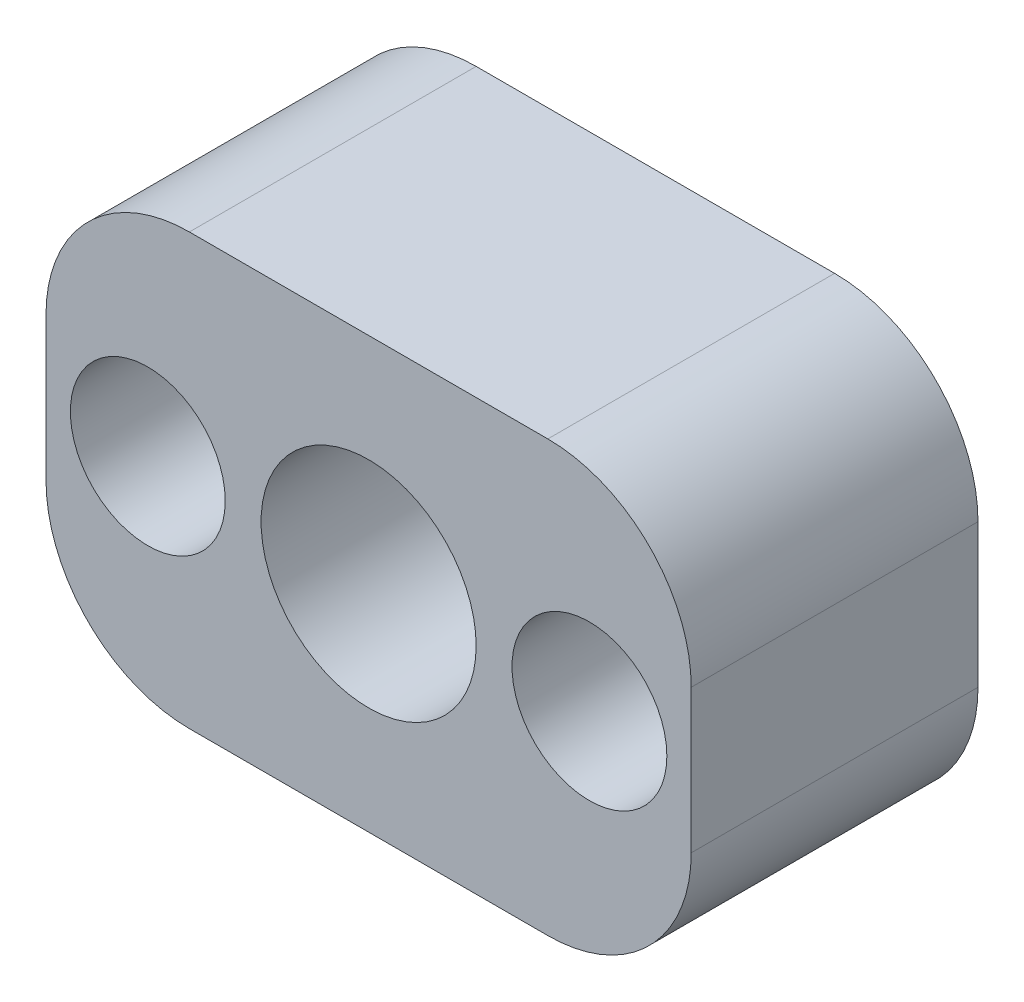
ISO-10303-21;
HEADER;
FILE_DESCRIPTION(('STEP AP214'),'2;1');
FILE_NAME('part.step','',(''),(''),'','','');
FILE_SCHEMA(('AUTOMOTIVE_DESIGN { 1 0 10303 214 1 1 1 1 }'));
ENDSEC;
DATA;
#1=APPLICATION_CONTEXT('core data for automotive mechanical design processes');
#2=APPLICATION_PROTOCOL_DEFINITION('international standard','automotive_design',2000,#1);
#3=PRODUCT_CONTEXT('',#1,'mechanical');
#4=PRODUCT('Part','Part','',(#3));
#5=PRODUCT_RELATED_PRODUCT_CATEGORY('part','',(#4));
#6=PRODUCT_DEFINITION_FORMATION('','',#4);
#7=PRODUCT_DEFINITION_CONTEXT('part definition',#1,'design');
#8=PRODUCT_DEFINITION('design','',#6,#7);
#9=PRODUCT_DEFINITION_SHAPE('','',#8);
#10=(LENGTH_UNIT() NAMED_UNIT(*) SI_UNIT(.MILLI.,.METRE.));
#11=(NAMED_UNIT(*) PLANE_ANGLE_UNIT() SI_UNIT($,.RADIAN.));
#12=(NAMED_UNIT(*) SI_UNIT($,.STERADIAN.) SOLID_ANGLE_UNIT());
#13=UNCERTAINTY_MEASURE_WITH_UNIT(LENGTH_MEASURE(1.E-05),#10,'distance_accuracy_value','');
#14=(GEOMETRIC_REPRESENTATION_CONTEXT(3) GLOBAL_UNCERTAINTY_ASSIGNED_CONTEXT((#13)) GLOBAL_UNIT_ASSIGNED_CONTEXT((#10,
#11,#12)) REPRESENTATION_CONTEXT('',''));
#15=CARTESIAN_POINT('',(0.,0.,0.));
#16=DIRECTION('',(0.,0.,1.));
#17=DIRECTION('',(1.,0.,0.));
#18=AXIS2_PLACEMENT_3D('',#15,#16,#17);
#19=CARTESIAN_POINT('',(-4.5085,-9.525,12.7));
#20=DIRECTION('',(0.,0.,-1.));
#21=DIRECTION('',(-1.,0.,0.));
#22=AXIS2_PLACEMENT_3D('',#19,#20,#21);
#23=CYLINDRICAL_SURFACE('',#22,1.905);
#24=CARTESIAN_POINT('',(-4.5085,-9.525,0.));
#25=DIRECTION('',(0.,0.,1.));
#26=DIRECTION('',(1.,0.,0.));
#27=AXIS2_PLACEMENT_3D('',#24,#25,#26);
#28=CIRCLE('',#27,1.905);
#29=CARTESIAN_POINT('',(-2.6035,-9.525,0.));
#30=VERTEX_POINT('',#29);
#31=EDGE_CURVE('E129',#30,#30,#28,.T.);
#32=ORIENTED_EDGE('',*,*,#31,.F.);
#33=EDGE_LOOP('',(#32));
#34=FACE_BOUND('',#33,.T.);
#35=CARTESIAN_POINT('',(-4.5085,-9.525,6.35));
#36=DIRECTION('',(0.,0.,1.));
#37=DIRECTION('',(1.,0.,0.));
#38=AXIS2_PLACEMENT_3D('',#35,#36,#37);
#39=CIRCLE('',#38,1.905);
#40=CARTESIAN_POINT('',(-2.6035,-9.525,6.35));
#41=VERTEX_POINT('',#40);
#42=EDGE_CURVE('E38',#41,#41,#39,.T.);
#43=ORIENTED_EDGE('',*,*,#42,.T.);
#44=EDGE_LOOP('',(#43));
#45=FACE_BOUND('',#44,.T.);
#46=ADVANCED_FACE('F34',(#34,#45),#23,.F.);
#47=CARTESIAN_POINT('',(-24.0665,-9.525,12.7));
#48=DIRECTION('',(0.,0.,-1.));
#49=DIRECTION('',(-1.,0.,0.));
#50=AXIS2_PLACEMENT_3D('',#47,#48,#49);
#51=CYLINDRICAL_SURFACE('',#50,1.905);
#52=CARTESIAN_POINT('',(-24.0665,-9.525,0.));
#53=DIRECTION('',(0.,0.,1.));
#54=DIRECTION('',(1.,0.,0.));
#55=AXIS2_PLACEMENT_3D('',#52,#53,#54);
#56=CIRCLE('',#55,1.905);
#57=CARTESIAN_POINT('',(-22.1615,-9.525,0.));
#58=VERTEX_POINT('',#57);
#59=EDGE_CURVE('E141',#58,#58,#56,.T.);
#60=ORIENTED_EDGE('',*,*,#59,.F.);
#61=EDGE_LOOP('',(#60));
#62=FACE_BOUND('',#61,.T.);
#63=CARTESIAN_POINT('',(-24.0665,-9.525,6.35));
#64=DIRECTION('',(0.,0.,1.));
#65=DIRECTION('',(1.,0.,0.));
#66=AXIS2_PLACEMENT_3D('',#63,#64,#65);
#67=CIRCLE('',#66,1.905);
#68=CARTESIAN_POINT('',(-22.1615,-9.525,6.35));
#69=VERTEX_POINT('',#68);
#70=EDGE_CURVE('E166',#69,#69,#67,.T.);
#71=ORIENTED_EDGE('',*,*,#70,.T.);
#72=EDGE_LOOP('',(#71));
#73=FACE_BOUND('',#72,.T.);
#74=ADVANCED_FACE('F222',(#62,#73),#51,.F.);
#75=CARTESIAN_POINT('',(0.,-19.05,12.7));
#76=DIRECTION('',(0.,-1.,0.));
#77=DIRECTION('',(0.,0.,-1.));
#78=AXIS2_PLACEMENT_3D('',#75,#76,#77);
#79=PLANE('',#78);
#80=DIRECTION('',(-1.,0.,0.));
#81=VECTOR('',#80,1.);
#82=CARTESIAN_POINT('',(0.,-19.05,12.7));
#83=LINE('',#82,#81);
#84=CARTESIAN_POINT('',(-6.35,-19.05,12.7));
#85=VERTEX_POINT('',#84);
#86=CARTESIAN_POINT('',(-22.225,-19.05,12.7));
#87=VERTEX_POINT('',#86);
#88=EDGE_CURVE('E144',#85,#87,#83,.T.);
#89=ORIENTED_EDGE('',*,*,#88,.T.);
#90=DIRECTION('',(0.,0.,-1.));
#91=VECTOR('',#90,1.);
#92=CARTESIAN_POINT('',(-22.225,-19.05,0.));
#93=LINE('',#92,#91);
#94=CARTESIAN_POINT('',(-22.225,-19.05,0.));
#95=VERTEX_POINT('',#94);
#96=EDGE_CURVE('E163',#87,#95,#93,.T.);
#97=ORIENTED_EDGE('',*,*,#96,.T.);
#98=DIRECTION('',(-1.,0.,0.));
#99=VECTOR('',#98,1.);
#100=CARTESIAN_POINT('',(0.,-19.05,0.));
#101=LINE('',#100,#99);
#102=CARTESIAN_POINT('',(-6.35,-19.05,0.));
#103=VERTEX_POINT('',#102);
#104=EDGE_CURVE('E172',#103,#95,#101,.T.);
#105=ORIENTED_EDGE('',*,*,#104,.F.);
#106=DIRECTION('',(0.,0.,-1.));
#107=VECTOR('',#106,1.);
#108=CARTESIAN_POINT('',(-6.35,-19.05,12.7));
#109=LINE('',#108,#107);
#110=EDGE_CURVE('E161',#103,#85,#109,.F.);
#111=ORIENTED_EDGE('',*,*,#110,.T.);
#112=EDGE_LOOP('',(#89,#97,#105,#111));
#113=FACE_BOUND('',#112,.T.);
#114=ADVANCED_FACE('F218',(#113),#79,.T.);
#115=CARTESIAN_POINT('',(0.,0.,12.7));
#116=DIRECTION('',(1.,0.,0.));
#117=DIRECTION('',(0.,1.,0.));
#118=AXIS2_PLACEMENT_3D('',#115,#116,#117);
#119=PLANE('',#118);
#120=DIRECTION('',(0.,-1.,0.));
#121=VECTOR('',#120,1.);
#122=CARTESIAN_POINT('',(0.,0.,12.7));
#123=LINE('',#122,#121);
#124=CARTESIAN_POINT('',(0.,-6.35,12.7));
#125=VERTEX_POINT('',#124);
#126=CARTESIAN_POINT('',(0.,-12.7,12.7));
#127=VERTEX_POINT('',#126);
#128=EDGE_CURVE('E189',#125,#127,#123,.T.);
#129=ORIENTED_EDGE('',*,*,#128,.T.);
#130=DIRECTION('',(0.,0.,-1.));
#131=VECTOR('',#130,1.);
#132=CARTESIAN_POINT('',(0.,-12.7,12.7));
#133=LINE('',#132,#131);
#134=CARTESIAN_POINT('',(0.,-12.7,0.));
#135=VERTEX_POINT('',#134);
#136=EDGE_CURVE('E11',#127,#135,#133,.T.);
#137=ORIENTED_EDGE('',*,*,#136,.T.);
#138=DIRECTION('',(0.,-1.,0.));
#139=VECTOR('',#138,1.);
#140=CARTESIAN_POINT('',(0.,0.,0.));
#141=LINE('',#140,#139);
#142=CARTESIAN_POINT('',(0.,-6.35,0.));
#143=VERTEX_POINT('',#142);
#144=EDGE_CURVE('E135',#143,#135,#141,.T.);
#145=ORIENTED_EDGE('',*,*,#144,.F.);
#146=DIRECTION('',(0.,0.,-1.));
#147=VECTOR('',#146,1.);
#148=CARTESIAN_POINT('',(0.,-6.35,12.7));
#149=LINE('',#148,#147);
#150=EDGE_CURVE('E43',#143,#125,#149,.F.);
#151=ORIENTED_EDGE('',*,*,#150,.T.);
#152=EDGE_LOOP('',(#129,#137,#145,#151));
#153=FACE_BOUND('',#152,.T.);
#154=ADVANCED_FACE('F199',(#153),#119,.T.);
#155=CARTESIAN_POINT('',(0.,0.,12.7));
#156=DIRECTION('',(0.,-1.,0.));
#157=DIRECTION('',(1.,0.,0.));
#158=AXIS2_PLACEMENT_3D('',#155,#156,#157);
#159=PLANE('',#158);
#160=DIRECTION('',(-1.,0.,0.));
#161=VECTOR('',#160,1.);
#162=CARTESIAN_POINT('',(0.,0.,0.));
#163=LINE('',#162,#161);
#164=CARTESIAN_POINT('',(-6.35,0.,0.));
#165=VERTEX_POINT('',#164);
#166=CARTESIAN_POINT('',(-22.225,0.,0.));
#167=VERTEX_POINT('',#166);
#168=EDGE_CURVE('E130',#165,#167,#163,.T.);
#169=ORIENTED_EDGE('',*,*,#168,.T.);
#170=DIRECTION('',(0.,0.,-1.));
#171=VECTOR('',#170,1.);
#172=CARTESIAN_POINT('',(-22.225,0.,12.7));
#173=LINE('',#172,#171);
#174=CARTESIAN_POINT('',(-22.225,0.,12.7));
#175=VERTEX_POINT('',#174);
#176=EDGE_CURVE('E107',#167,#175,#173,.F.);
#177=ORIENTED_EDGE('',*,*,#176,.T.);
#178=DIRECTION('',(-1.,0.,0.));
#179=VECTOR('',#178,1.);
#180=CARTESIAN_POINT('',(0.,0.,12.7));
#181=LINE('',#180,#179);
#182=CARTESIAN_POINT('',(-6.35,0.,12.7));
#183=VERTEX_POINT('',#182);
#184=EDGE_CURVE('E191',#183,#175,#181,.T.);
#185=ORIENTED_EDGE('',*,*,#184,.F.);
#186=DIRECTION('',(0.,0.,-1.));
#187=VECTOR('',#186,1.);
#188=CARTESIAN_POINT('',(-6.35,0.,0.));
#189=LINE('',#188,#187);
#190=EDGE_CURVE('E112',#183,#165,#189,.T.);
#191=ORIENTED_EDGE('',*,*,#190,.T.);
#192=EDGE_LOOP('',(#169,#177,#185,#191));
#193=FACE_BOUND('',#192,.T.);
#194=ADVANCED_FACE('F208',(#193),#159,.F.);
#195=CARTESIAN_POINT('',(-14.2875,-9.525,12.7));
#196=DIRECTION('',(0.,0.,-1.));
#197=DIRECTION('',(-1.,0.,0.));
#198=AXIS2_PLACEMENT_3D('',#195,#196,#197);
#199=CYLINDRICAL_SURFACE('',#198,4.7625);
#200=CARTESIAN_POINT('',(-14.2875,-9.525,12.7));
#201=DIRECTION('',(0.,0.,1.));
#202=DIRECTION('',(1.,0.,0.));
#203=AXIS2_PLACEMENT_3D('',#200,#201,#202);
#204=CIRCLE('',#203,4.7625);
#205=CARTESIAN_POINT('',(-9.525,-9.525,12.7));
#206=VERTEX_POINT('',#205);
#207=EDGE_CURVE('E145',#206,#206,#204,.T.);
#208=ORIENTED_EDGE('',*,*,#207,.T.);
#209=EDGE_LOOP('',(#208));
#210=FACE_BOUND('',#209,.T.);
#211=CARTESIAN_POINT('',(-14.2875,-9.525,0.));
#212=DIRECTION('',(0.,0.,1.));
#213=DIRECTION('',(1.,0.,0.));
#214=AXIS2_PLACEMENT_3D('',#211,#212,#213);
#215=CIRCLE('',#214,4.7625);
#216=CARTESIAN_POINT('',(-9.525,-9.525,0.));
#217=VERTEX_POINT('',#216);
#218=EDGE_CURVE('E133',#217,#217,#215,.T.);
#219=ORIENTED_EDGE('',*,*,#218,.F.);
#220=EDGE_LOOP('',(#219));
#221=FACE_BOUND('',#220,.T.);
#222=ADVANCED_FACE('F210',(#210,#221),#199,.F.);
#223=CARTESIAN_POINT('',(-28.575,0.,12.7));
#224=DIRECTION('',(1.,0.,0.));
#225=DIRECTION('',(0.,0.,-1.));
#226=AXIS2_PLACEMENT_3D('',#223,#224,#225);
#227=PLANE('',#226);
#228=DIRECTION('',(0.,-1.,0.));
#229=VECTOR('',#228,1.);
#230=CARTESIAN_POINT('',(-28.575,0.,12.7));
#231=LINE('',#230,#229);
#232=CARTESIAN_POINT('',(-28.575,-6.35,12.7));
#233=VERTEX_POINT('',#232);
#234=CARTESIAN_POINT('',(-28.575,-12.7,12.7));
#235=VERTEX_POINT('',#234);
#236=EDGE_CURVE('E122',#233,#235,#231,.T.);
#237=ORIENTED_EDGE('',*,*,#236,.F.);
#238=DIRECTION('',(0.,0.,-1.));
#239=VECTOR('',#238,1.);
#240=CARTESIAN_POINT('',(-28.575,-6.35,12.7));
#241=LINE('',#240,#239);
#242=CARTESIAN_POINT('',(-28.575,-6.35,0.));
#243=VERTEX_POINT('',#242);
#244=EDGE_CURVE('E106',#233,#243,#241,.T.);
#245=ORIENTED_EDGE('',*,*,#244,.T.);
#246=DIRECTION('',(0.,-1.,0.));
#247=VECTOR('',#246,1.);
#248=CARTESIAN_POINT('',(-28.575,0.,0.));
#249=LINE('',#248,#247);
#250=CARTESIAN_POINT('',(-28.575,-12.7,0.));
#251=VERTEX_POINT('',#250);
#252=EDGE_CURVE('E119',#243,#251,#249,.T.);
#253=ORIENTED_EDGE('',*,*,#252,.T.);
#254=DIRECTION('',(0.,0.,-1.));
#255=VECTOR('',#254,1.);
#256=CARTESIAN_POINT('',(-28.575,-12.7,12.7));
#257=LINE('',#256,#255);
#258=EDGE_CURVE('E124',#251,#235,#257,.F.);
#259=ORIENTED_EDGE('',*,*,#258,.T.);
#260=EDGE_LOOP('',(#237,#245,#253,#259));
#261=FACE_BOUND('',#260,.T.);
#262=ADVANCED_FACE('F118',(#261),#227,.F.);
#263=CARTESIAN_POINT('',(0.,0.,12.7));
#264=DIRECTION('',(0.,0.,1.));
#265=DIRECTION('',(1.,0.,0.));
#266=AXIS2_PLACEMENT_3D('',#263,#264,#265);
#267=PLANE('',#266);
#268=CARTESIAN_POINT('',(-24.0665,-9.525,12.7));
#269=DIRECTION('',(0.,0.,1.));
#270=DIRECTION('',(1.,0.,0.));
#271=AXIS2_PLACEMENT_3D('',#268,#269,#270);
#272=CIRCLE('',#271,3.429);
#273=CARTESIAN_POINT('',(-20.6375,-9.525,12.7));
#274=VERTEX_POINT('',#273);
#275=EDGE_CURVE('E174',#274,#274,#272,.T.);
#276=ORIENTED_EDGE('',*,*,#275,.F.);
#277=EDGE_LOOP('',(#276));
#278=FACE_BOUND('',#277,.T.);
#279=CARTESIAN_POINT('',(-4.5085,-9.525,12.7));
#280=DIRECTION('',(0.,0.,1.));
#281=DIRECTION('',(1.,0.,0.));
#282=AXIS2_PLACEMENT_3D('',#279,#280,#281);
#283=CIRCLE('',#282,3.429);
#284=CARTESIAN_POINT('',(-1.0795,-9.525,12.7));
#285=VERTEX_POINT('',#284);
#286=EDGE_CURVE('E184',#285,#285,#283,.T.);
#287=ORIENTED_EDGE('',*,*,#286,.F.);
#288=EDGE_LOOP('',(#287));
#289=FACE_BOUND('',#288,.T.);
#290=ORIENTED_EDGE('',*,*,#184,.T.);
#291=CARTESIAN_POINT('',(-22.225,-6.35,12.7));
#292=DIRECTION('',(0.,0.,1.));
#293=DIRECTION('',(1.,0.,0.));
#294=AXIS2_PLACEMENT_3D('',#291,#292,#293);
#295=CIRCLE('',#294,6.35);
#296=EDGE_CURVE('E159',#175,#233,#295,.T.);
#297=ORIENTED_EDGE('',*,*,#296,.T.);
#298=ORIENTED_EDGE('',*,*,#236,.T.);
#299=CARTESIAN_POINT('',(-22.225,-12.7,12.7));
#300=DIRECTION('',(0.,0.,1.));
#301=DIRECTION('',(1.,0.,0.));
#302=AXIS2_PLACEMENT_3D('',#299,#300,#301);
#303=CIRCLE('',#302,6.35);
#304=EDGE_CURVE('E157',#235,#87,#303,.T.);
#305=ORIENTED_EDGE('',*,*,#304,.T.);
#306=ORIENTED_EDGE('',*,*,#88,.F.);
#307=CARTESIAN_POINT('',(-6.35,-12.7,12.7));
#308=DIRECTION('',(0.,0.,1.));
#309=DIRECTION('',(1.,0.,0.));
#310=AXIS2_PLACEMENT_3D('',#307,#308,#309);
#311=CIRCLE('',#310,6.35);
#312=EDGE_CURVE('E51',#85,#127,#311,.T.);
#313=ORIENTED_EDGE('',*,*,#312,.T.);
#314=ORIENTED_EDGE('',*,*,#128,.F.);
#315=CARTESIAN_POINT('',(-6.35,-6.35,12.7));
#316=DIRECTION('',(0.,0.,1.));
#317=DIRECTION('',(1.,0.,0.));
#318=AXIS2_PLACEMENT_3D('',#315,#316,#317);
#319=CIRCLE('',#318,6.35);
#320=EDGE_CURVE('E154',#125,#183,#319,.T.);
#321=ORIENTED_EDGE('',*,*,#320,.T.);
#322=EDGE_LOOP('',(#290,#297,#298,#305,#306,#313,#314,#321));
#323=FACE_BOUND('',#322,.T.);
#324=ORIENTED_EDGE('',*,*,#207,.F.);
#325=EDGE_LOOP('',(#324));
#326=FACE_BOUND('',#325,.T.);
#327=ADVANCED_FACE('F205',(#278,#289,#323,#326),#267,.T.);
#328=CARTESIAN_POINT('',(0.,0.,0.));
#329=DIRECTION('',(0.,0.,1.));
#330=DIRECTION('',(1.,0.,0.));
#331=AXIS2_PLACEMENT_3D('',#328,#329,#330);
#332=PLANE('',#331);
#333=ORIENTED_EDGE('',*,*,#252,.F.);
#334=CARTESIAN_POINT('',(-22.225,-6.35,0.));
#335=DIRECTION('',(0.,0.,1.));
#336=DIRECTION('',(1.,0.,0.));
#337=AXIS2_PLACEMENT_3D('',#334,#335,#336);
#338=CIRCLE('',#337,6.35);
#339=EDGE_CURVE('E102',#243,#167,#338,.F.);
#340=ORIENTED_EDGE('',*,*,#339,.T.);
#341=ORIENTED_EDGE('',*,*,#168,.F.);
#342=CARTESIAN_POINT('',(-6.35,-6.35,0.));
#343=DIRECTION('',(0.,0.,1.));
#344=DIRECTION('',(1.,0.,0.));
#345=AXIS2_PLACEMENT_3D('',#342,#343,#344);
#346=CIRCLE('',#345,6.35);
#347=EDGE_CURVE('E123',#165,#143,#346,.F.);
#348=ORIENTED_EDGE('',*,*,#347,.T.);
#349=ORIENTED_EDGE('',*,*,#144,.T.);
#350=CARTESIAN_POINT('',(-6.35,-12.7,0.));
#351=DIRECTION('',(0.,0.,1.));
#352=DIRECTION('',(1.,0.,0.));
#353=AXIS2_PLACEMENT_3D('',#350,#351,#352);
#354=CIRCLE('',#353,6.35);
#355=EDGE_CURVE('E148',#135,#103,#354,.F.);
#356=ORIENTED_EDGE('',*,*,#355,.T.);
#357=ORIENTED_EDGE('',*,*,#104,.T.);
#358=CARTESIAN_POINT('',(-22.225,-12.7,0.));
#359=DIRECTION('',(0.,0.,1.));
#360=DIRECTION('',(1.,0.,0.));
#361=AXIS2_PLACEMENT_3D('',#358,#359,#360);
#362=CIRCLE('',#361,6.35);
#363=EDGE_CURVE('E113',#95,#251,#362,.F.);
#364=ORIENTED_EDGE('',*,*,#363,.T.);
#365=EDGE_LOOP('',(#333,#340,#341,#348,#349,#356,#357,#364));
#366=FACE_BOUND('',#365,.T.);
#367=ORIENTED_EDGE('',*,*,#31,.T.);
#368=EDGE_LOOP('',(#367));
#369=FACE_BOUND('',#368,.T.);
#370=ORIENTED_EDGE('',*,*,#218,.T.);
#371=EDGE_LOOP('',(#370));
#372=FACE_BOUND('',#371,.T.);
#373=ORIENTED_EDGE('',*,*,#59,.T.);
#374=EDGE_LOOP('',(#373));
#375=FACE_BOUND('',#374,.T.);
#376=ADVANCED_FACE('F126',(#366,#369,#372,#375),#332,.F.);
#377=CARTESIAN_POINT('',(-22.225,-6.35,12.7));
#378=DIRECTION('',(0.,0.,-1.));
#379=DIRECTION('',(-1.,0.,0.));
#380=AXIS2_PLACEMENT_3D('',#377,#378,#379);
#381=CYLINDRICAL_SURFACE('',#380,6.35);
#382=ORIENTED_EDGE('',*,*,#296,.F.);
#383=ORIENTED_EDGE('',*,*,#176,.F.);
#384=ORIENTED_EDGE('',*,*,#339,.F.);
#385=ORIENTED_EDGE('',*,*,#244,.F.);
#386=EDGE_LOOP('',(#382,#383,#384,#385));
#387=FACE_BOUND('',#386,.T.);
#388=ADVANCED_FACE('F105',(#387),#381,.T.);
#389=CARTESIAN_POINT('',(-22.225,-12.7,12.7));
#390=DIRECTION('',(0.,0.,1.));
#391=DIRECTION('',(1.,0.,0.));
#392=AXIS2_PLACEMENT_3D('',#389,#390,#391);
#393=CYLINDRICAL_SURFACE('',#392,6.35);
#394=ORIENTED_EDGE('',*,*,#304,.F.);
#395=ORIENTED_EDGE('',*,*,#258,.F.);
#396=ORIENTED_EDGE('',*,*,#363,.F.);
#397=ORIENTED_EDGE('',*,*,#96,.F.);
#398=EDGE_LOOP('',(#394,#395,#396,#397));
#399=FACE_BOUND('',#398,.T.);
#400=ADVANCED_FACE('F286',(#399),#393,.T.);
#401=CARTESIAN_POINT('',(-6.35,-12.7,12.7));
#402=DIRECTION('',(0.,0.,-1.));
#403=DIRECTION('',(-1.,0.,0.));
#404=AXIS2_PLACEMENT_3D('',#401,#402,#403);
#405=CYLINDRICAL_SURFACE('',#404,6.35);
#406=ORIENTED_EDGE('',*,*,#312,.F.);
#407=ORIENTED_EDGE('',*,*,#110,.F.);
#408=ORIENTED_EDGE('',*,*,#355,.F.);
#409=ORIENTED_EDGE('',*,*,#136,.F.);
#410=EDGE_LOOP('',(#406,#407,#408,#409));
#411=FACE_BOUND('',#410,.T.);
#412=ADVANCED_FACE('F280',(#411),#405,.T.);
#413=CARTESIAN_POINT('',(-6.35,-6.35,12.7));
#414=DIRECTION('',(0.,0.,1.));
#415=DIRECTION('',(1.,0.,0.));
#416=AXIS2_PLACEMENT_3D('',#413,#414,#415);
#417=CYLINDRICAL_SURFACE('',#416,6.35);
#418=ORIENTED_EDGE('',*,*,#320,.F.);
#419=ORIENTED_EDGE('',*,*,#150,.F.);
#420=ORIENTED_EDGE('',*,*,#347,.F.);
#421=ORIENTED_EDGE('',*,*,#190,.F.);
#422=EDGE_LOOP('',(#418,#419,#420,#421));
#423=FACE_BOUND('',#422,.T.);
#424=ADVANCED_FACE('F36',(#423),#417,.T.);
#425=CARTESIAN_POINT('',(-4.5085,-9.525,6.35));
#426=DIRECTION('',(0.,0.,1.));
#427=DIRECTION('',(1.,0.,0.));
#428=AXIS2_PLACEMENT_3D('',#425,#426,#427);
#429=CYLINDRICAL_SURFACE('',#428,3.429);
#430=CARTESIAN_POINT('',(-4.5085,-9.525,6.35));
#431=DIRECTION('',(0.,0.,1.));
#432=DIRECTION('',(1.,0.,0.));
#433=AXIS2_PLACEMENT_3D('',#430,#431,#432);
#434=CIRCLE('',#433,3.429);
#435=CARTESIAN_POINT('',(-1.0795,-9.525,6.35));
#436=VERTEX_POINT('',#435);
#437=EDGE_CURVE('E179',#436,#436,#434,.T.);
#438=ORIENTED_EDGE('',*,*,#437,.F.);
#439=EDGE_LOOP('',(#438));
#440=FACE_BOUND('',#439,.T.);
#441=ORIENTED_EDGE('',*,*,#286,.T.);
#442=EDGE_LOOP('',(#441));
#443=FACE_BOUND('',#442,.T.);
#444=ADVANCED_FACE('F245',(#440,#443),#429,.F.);
#445=CARTESIAN_POINT('',(-4.5085,-9.525,6.35));
#446=DIRECTION('',(0.,0.,1.));
#447=DIRECTION('',(1.,0.,0.));
#448=AXIS2_PLACEMENT_3D('',#445,#446,#447);
#449=PLANE('',#448);
#450=ORIENTED_EDGE('',*,*,#42,.F.);
#451=EDGE_LOOP('',(#450));
#452=FACE_BOUND('',#451,.T.);
#453=ORIENTED_EDGE('',*,*,#437,.T.);
#454=EDGE_LOOP('',(#453));
#455=FACE_BOUND('',#454,.T.);
#456=ADVANCED_FACE('F248',(#452,#455),#449,.T.);
#457=CARTESIAN_POINT('',(-24.0665,-9.525,6.35));
#458=DIRECTION('',(0.,0.,1.));
#459=DIRECTION('',(1.,0.,0.));
#460=AXIS2_PLACEMENT_3D('',#457,#458,#459);
#461=CYLINDRICAL_SURFACE('',#460,3.429);
#462=CARTESIAN_POINT('',(-24.0665,-9.525,6.35));
#463=DIRECTION('',(0.,0.,1.));
#464=DIRECTION('',(1.,0.,0.));
#465=AXIS2_PLACEMENT_3D('',#462,#463,#464);
#466=CIRCLE('',#465,3.429);
#467=CARTESIAN_POINT('',(-20.6375,-9.525,6.35));
#468=VERTEX_POINT('',#467);
#469=EDGE_CURVE('E168',#468,#468,#466,.T.);
#470=ORIENTED_EDGE('',*,*,#469,.F.);
#471=EDGE_LOOP('',(#470));
#472=FACE_BOUND('',#471,.T.);
#473=ORIENTED_EDGE('',*,*,#275,.T.);
#474=EDGE_LOOP('',(#473));
#475=FACE_BOUND('',#474,.T.);
#476=ADVANCED_FACE('F252',(#472,#475),#461,.F.);
#477=CARTESIAN_POINT('',(-24.0665,-9.525,6.35));
#478=DIRECTION('',(0.,0.,1.));
#479=DIRECTION('',(1.,0.,0.));
#480=AXIS2_PLACEMENT_3D('',#477,#478,#479);
#481=PLANE('',#480);
#482=ORIENTED_EDGE('',*,*,#70,.F.);
#483=EDGE_LOOP('',(#482));
#484=FACE_BOUND('',#483,.T.);
#485=ORIENTED_EDGE('',*,*,#469,.T.);
#486=EDGE_LOOP('',(#485));
#487=FACE_BOUND('',#486,.T.);
#488=ADVANCED_FACE('F256',(#484,#487),#481,.T.);
#489=CLOSED_SHELL('',(#46,#74,#114,#154,#194,#222,#262,#327,#376,#388,#400,#412,#424,#444,#456,
#476,#488));
#490=MANIFOLD_SOLID_BREP('B2',#489);
#491=ADVANCED_BREP_SHAPE_REPRESENTATION('',(#18,#490),#14);
#492=SHAPE_DEFINITION_REPRESENTATION(#9,#491);
ENDSEC;
END-ISO-10303-21;
